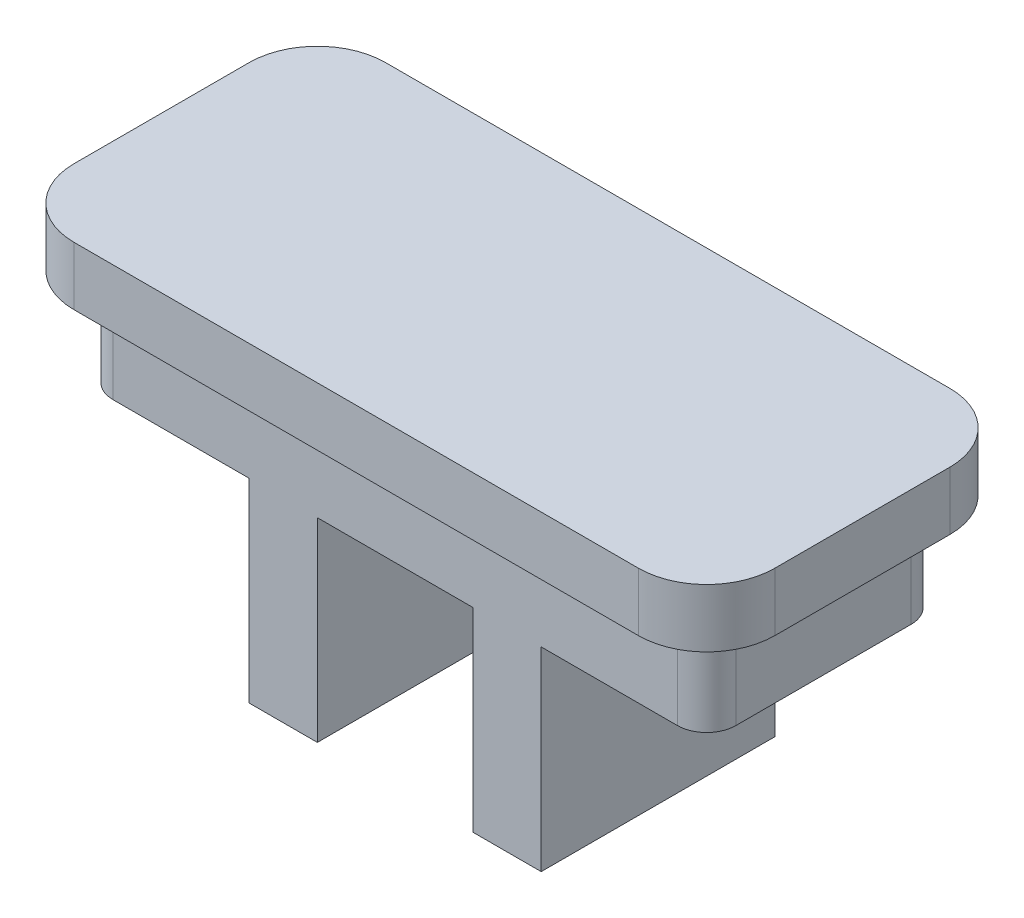
ISO-10303-21;
HEADER;
FILE_DESCRIPTION(('STEP AP214'),'2;1');
FILE_NAME('part.step','',(''),(''),'','','');
FILE_SCHEMA(('AUTOMOTIVE_DESIGN { 1 0 10303 214 1 1 1 1 }'));
ENDSEC;
DATA;
#1=APPLICATION_CONTEXT('core data for automotive mechanical design processes');
#2=APPLICATION_PROTOCOL_DEFINITION('international standard','automotive_design',2000,#1);
#3=PRODUCT_CONTEXT('',#1,'mechanical');
#4=PRODUCT('Part','Part','',(#3));
#5=PRODUCT_RELATED_PRODUCT_CATEGORY('part','',(#4));
#6=PRODUCT_DEFINITION_FORMATION('','',#4);
#7=PRODUCT_DEFINITION_CONTEXT('part definition',#1,'design');
#8=PRODUCT_DEFINITION('design','',#6,#7);
#9=PRODUCT_DEFINITION_SHAPE('','',#8);
#10=(LENGTH_UNIT() NAMED_UNIT(*) SI_UNIT(.MILLI.,.METRE.));
#11=(NAMED_UNIT(*) PLANE_ANGLE_UNIT() SI_UNIT($,.RADIAN.));
#12=(NAMED_UNIT(*) SI_UNIT($,.STERADIAN.) SOLID_ANGLE_UNIT());
#13=UNCERTAINTY_MEASURE_WITH_UNIT(LENGTH_MEASURE(1.E-05),#10,'distance_accuracy_value','');
#14=(GEOMETRIC_REPRESENTATION_CONTEXT(3) GLOBAL_UNCERTAINTY_ASSIGNED_CONTEXT((#13)) GLOBAL_UNIT_ASSIGNED_CONTEXT((#10,
#11,#12)) REPRESENTATION_CONTEXT('',''));
#15=CARTESIAN_POINT('',(0.,0.,0.));
#16=DIRECTION('',(0.,0.,1.));
#17=DIRECTION('',(1.,0.,0.));
#18=AXIS2_PLACEMENT_3D('',#15,#16,#17);
#19=CARTESIAN_POINT('',(30.5,15.,-10.5));
#20=DIRECTION('',(0.,-1.,0.));
#21=DIRECTION('',(0.,0.,-1.));
#22=AXIS2_PLACEMENT_3D('',#19,#20,#21);
#23=CYLINDRICAL_SURFACE('',#22,1.5);
#24=CARTESIAN_POINT('',(30.5,10.,-10.5));
#25=DIRECTION('',(0.,-1.,0.));
#26=DIRECTION('',(0.,0.,-1.));
#27=AXIS2_PLACEMENT_3D('',#24,#25,#26);
#28=CIRCLE('',#27,1.5);
#29=CARTESIAN_POINT('',(30.5,10.,-12.));
#30=VERTEX_POINT('',#29);
#31=CARTESIAN_POINT('',(32.,10.,-10.5));
#32=VERTEX_POINT('',#31);
#33=EDGE_CURVE('E212',#30,#32,#28,.T.);
#34=ORIENTED_EDGE('',*,*,#33,.F.);
#35=DIRECTION('',(0.,-1.,0.));
#36=VECTOR('',#35,1.);
#37=CARTESIAN_POINT('',(30.5,15.,-12.));
#38=LINE('',#37,#36);
#39=CARTESIAN_POINT('',(30.5,15.,-12.));
#40=VERTEX_POINT('',#39);
#41=EDGE_CURVE('E11',#40,#30,#38,.T.);
#42=ORIENTED_EDGE('',*,*,#41,.F.);
#43=CARTESIAN_POINT('',(30.5,15.,-10.5));
#44=DIRECTION('',(0.,1.,0.));
#45=DIRECTION('',(0.,0.,-1.));
#46=AXIS2_PLACEMENT_3D('',#43,#44,#45);
#47=CIRCLE('',#46,1.5);
#48=CARTESIAN_POINT('',(32.,15.,-10.5));
#49=VERTEX_POINT('',#48);
#50=EDGE_CURVE('E328',#49,#40,#47,.T.);
#51=ORIENTED_EDGE('',*,*,#50,.F.);
#52=DIRECTION('',(0.,-1.,0.));
#53=VECTOR('',#52,1.);
#54=CARTESIAN_POINT('',(32.,15.,-10.5));
#55=LINE('',#54,#53);
#56=EDGE_CURVE('E353',#49,#32,#55,.T.);
#57=ORIENTED_EDGE('',*,*,#56,.T.);
#58=EDGE_LOOP('',(#34,#42,#51,#57));
#59=FACE_BOUND('',#58,.T.);
#60=ADVANCED_FACE('F35',(#59),#23,.T.);
#61=CARTESIAN_POINT('',(1.5,15.,-10.5));
#62=DIRECTION('',(0.,-1.,0.));
#63=DIRECTION('',(0.,0.,-1.));
#64=AXIS2_PLACEMENT_3D('',#61,#62,#63);
#65=CYLINDRICAL_SURFACE('',#64,1.5);
#66=CARTESIAN_POINT('',(1.5,10.,-10.5));
#67=DIRECTION('',(0.,-1.,0.));
#68=DIRECTION('',(0.,0.,-1.));
#69=AXIS2_PLACEMENT_3D('',#66,#67,#68);
#70=CIRCLE('',#69,1.5);
#71=CARTESIAN_POINT('',(0.,10.,-10.5));
#72=VERTEX_POINT('',#71);
#73=CARTESIAN_POINT('',(1.50000000000001,10.,-12.));
#74=VERTEX_POINT('',#73);
#75=EDGE_CURVE('E230',#72,#74,#70,.T.);
#76=ORIENTED_EDGE('',*,*,#75,.F.);
#77=DIRECTION('',(0.,-1.,0.));
#78=VECTOR('',#77,1.);
#79=CARTESIAN_POINT('',(0.,15.,-10.5));
#80=LINE('',#79,#78);
#81=CARTESIAN_POINT('',(0.,15.,-10.5));
#82=VERTEX_POINT('',#81);
#83=EDGE_CURVE('E372',#82,#72,#80,.T.);
#84=ORIENTED_EDGE('',*,*,#83,.F.);
#85=CARTESIAN_POINT('',(1.5,15.,-10.5));
#86=DIRECTION('',(0.,1.,0.));
#87=DIRECTION('',(0.,0.,-1.));
#88=AXIS2_PLACEMENT_3D('',#85,#86,#87);
#89=CIRCLE('',#88,1.5);
#90=CARTESIAN_POINT('',(1.50000000000001,15.,-12.));
#91=VERTEX_POINT('',#90);
#92=EDGE_CURVE('E335',#91,#82,#89,.T.);
#93=ORIENTED_EDGE('',*,*,#92,.F.);
#94=DIRECTION('',(0.,-1.,0.));
#95=VECTOR('',#94,1.);
#96=CARTESIAN_POINT('',(1.50000000000001,15.,-12.));
#97=LINE('',#96,#95);
#98=EDGE_CURVE('E42',#91,#74,#97,.T.);
#99=ORIENTED_EDGE('',*,*,#98,.T.);
#100=EDGE_LOOP('',(#76,#84,#93,#99));
#101=FACE_BOUND('',#100,.T.);
#102=ADVANCED_FACE('F378',(#101),#65,.T.);
#103=CARTESIAN_POINT('',(0.,15.,-1.50000000000001));
#104=DIRECTION('',(1.,0.,0.));
#105=DIRECTION('',(0.,0.,-1.));
#106=AXIS2_PLACEMENT_3D('',#103,#104,#105);
#107=PLANE('',#106);
#108=DIRECTION('',(0.,0.,-1.));
#109=VECTOR('',#108,1.);
#110=CARTESIAN_POINT('',(0.,10.,-1.50000000000001));
#111=LINE('',#110,#109);
#112=CARTESIAN_POINT('',(0.,10.,-1.50000000000001));
#113=VERTEX_POINT('',#112);
#114=EDGE_CURVE('E227',#113,#72,#111,.T.);
#115=ORIENTED_EDGE('',*,*,#114,.F.);
#116=DIRECTION('',(0.,-1.,0.));
#117=VECTOR('',#116,1.);
#118=CARTESIAN_POINT('',(0.,15.,-1.50000000000001));
#119=LINE('',#118,#117);
#120=CARTESIAN_POINT('',(0.,15.,-1.50000000000001));
#121=VERTEX_POINT('',#120);
#122=EDGE_CURVE('E369',#121,#113,#119,.T.);
#123=ORIENTED_EDGE('',*,*,#122,.F.);
#124=DIRECTION('',(0.,0.,1.));
#125=VECTOR('',#124,1.);
#126=CARTESIAN_POINT('',(0.,15.,-1.50000000000001));
#127=LINE('',#126,#125);
#128=EDGE_CURVE('E338',#82,#121,#127,.T.);
#129=ORIENTED_EDGE('',*,*,#128,.F.);
#130=ORIENTED_EDGE('',*,*,#83,.T.);
#131=EDGE_LOOP('',(#115,#123,#129,#130));
#132=FACE_BOUND('',#131,.T.);
#133=ADVANCED_FACE('F386',(#132),#107,.F.);
#134=CARTESIAN_POINT('',(1.5,15.,-1.5));
#135=DIRECTION('',(0.,-1.,0.));
#136=DIRECTION('',(0.,0.,-1.));
#137=AXIS2_PLACEMENT_3D('',#134,#135,#136);
#138=CYLINDRICAL_SURFACE('',#137,1.5);
#139=CARTESIAN_POINT('',(1.5,10.,-1.5));
#140=DIRECTION('',(0.,-1.,0.));
#141=DIRECTION('',(0.,0.,-1.));
#142=AXIS2_PLACEMENT_3D('',#139,#140,#141);
#143=CIRCLE('',#142,1.5);
#144=CARTESIAN_POINT('',(1.50000000000001,10.,0.));
#145=VERTEX_POINT('',#144);
#146=EDGE_CURVE('E225',#145,#113,#143,.T.);
#147=ORIENTED_EDGE('',*,*,#146,.F.);
#148=DIRECTION('',(0.,-1.,0.));
#149=VECTOR('',#148,1.);
#150=CARTESIAN_POINT('',(1.50000000000001,15.,0.));
#151=LINE('',#150,#149);
#152=CARTESIAN_POINT('',(1.50000000000001,15.,0.));
#153=VERTEX_POINT('',#152);
#154=EDGE_CURVE('E366',#153,#145,#151,.T.);
#155=ORIENTED_EDGE('',*,*,#154,.F.);
#156=CARTESIAN_POINT('',(1.5,15.,-1.5));
#157=DIRECTION('',(0.,1.,0.));
#158=DIRECTION('',(0.,0.,-1.));
#159=AXIS2_PLACEMENT_3D('',#156,#157,#158);
#160=CIRCLE('',#159,1.5);
#161=EDGE_CURVE('E341',#121,#153,#160,.T.);
#162=ORIENTED_EDGE('',*,*,#161,.F.);
#163=ORIENTED_EDGE('',*,*,#122,.T.);
#164=EDGE_LOOP('',(#147,#155,#162,#163));
#165=FACE_BOUND('',#164,.T.);
#166=ADVANCED_FACE('F390',(#165),#138,.T.);
#167=CARTESIAN_POINT('',(30.5,15.,-1.5));
#168=DIRECTION('',(0.,-1.,0.));
#169=DIRECTION('',(0.,0.,-1.));
#170=AXIS2_PLACEMENT_3D('',#167,#168,#169);
#171=CYLINDRICAL_SURFACE('',#170,1.5);
#172=CARTESIAN_POINT('',(30.5,10.,-1.5));
#173=DIRECTION('',(0.,-1.,0.));
#174=DIRECTION('',(0.,0.,-1.));
#175=AXIS2_PLACEMENT_3D('',#172,#173,#174);
#176=CIRCLE('',#175,1.5);
#177=CARTESIAN_POINT('',(32.,10.,-1.50000000000001));
#178=VERTEX_POINT('',#177);
#179=CARTESIAN_POINT('',(30.5,10.,0.));
#180=VERTEX_POINT('',#179);
#181=EDGE_CURVE('E218',#178,#180,#176,.T.);
#182=ORIENTED_EDGE('',*,*,#181,.F.);
#183=DIRECTION('',(0.,-1.,0.));
#184=VECTOR('',#183,1.);
#185=CARTESIAN_POINT('',(32.,15.,-1.50000000000001));
#186=LINE('',#185,#184);
#187=CARTESIAN_POINT('',(32.,15.,-1.50000000000001));
#188=VERTEX_POINT('',#187);
#189=EDGE_CURVE('E360',#188,#178,#186,.T.);
#190=ORIENTED_EDGE('',*,*,#189,.F.);
#191=CARTESIAN_POINT('',(30.5,15.,-1.5));
#192=DIRECTION('',(0.,1.,0.));
#193=DIRECTION('',(0.,0.,1.));
#194=AXIS2_PLACEMENT_3D('',#191,#192,#193);
#195=CIRCLE('',#194,1.5);
#196=CARTESIAN_POINT('',(30.5,15.,0.));
#197=VERTEX_POINT('',#196);
#198=EDGE_CURVE('E347',#197,#188,#195,.T.);
#199=ORIENTED_EDGE('',*,*,#198,.F.);
#200=DIRECTION('',(0.,-1.,0.));
#201=VECTOR('',#200,1.);
#202=CARTESIAN_POINT('',(30.5,15.,0.));
#203=LINE('',#202,#201);
#204=EDGE_CURVE('E363',#197,#180,#203,.T.);
#205=ORIENTED_EDGE('',*,*,#204,.T.);
#206=EDGE_LOOP('',(#182,#190,#199,#205));
#207=FACE_BOUND('',#206,.T.);
#208=ADVANCED_FACE('F402',(#207),#171,.T.);
#209=CARTESIAN_POINT('',(32.,15.,-1.50000000000001));
#210=DIRECTION('',(-1.,0.,0.));
#211=DIRECTION('',(0.,0.,1.));
#212=AXIS2_PLACEMENT_3D('',#209,#210,#211);
#213=PLANE('',#212);
#214=DIRECTION('',(0.,0.,1.));
#215=VECTOR('',#214,1.);
#216=CARTESIAN_POINT('',(32.,10.,-10.5));
#217=LINE('',#216,#215);
#218=EDGE_CURVE('E214',#32,#178,#217,.T.);
#219=ORIENTED_EDGE('',*,*,#218,.F.);
#220=ORIENTED_EDGE('',*,*,#56,.F.);
#221=DIRECTION('',(0.,0.,-1.));
#222=VECTOR('',#221,1.);
#223=CARTESIAN_POINT('',(32.,15.,-1.50000000000001));
#224=LINE('',#223,#222);
#225=EDGE_CURVE('E350',#188,#49,#224,.T.);
#226=ORIENTED_EDGE('',*,*,#225,.F.);
#227=ORIENTED_EDGE('',*,*,#189,.T.);
#228=EDGE_LOOP('',(#219,#220,#226,#227));
#229=FACE_BOUND('',#228,.T.);
#230=ADVANCED_FACE('F399',(#229),#213,.F.);
#231=CARTESIAN_POINT('',(30.5,0.,-10.5));
#232=DIRECTION('',(0.,-1.,0.));
#233=DIRECTION('',(0.,0.,-1.));
#234=AXIS2_PLACEMENT_3D('',#231,#232,#233);
#235=PLANE('',#234);
#236=DIRECTION('',(0.,0.,1.));
#237=VECTOR('',#236,1.);
#238=CARTESIAN_POINT('',(8.50000000000001,0.,-12.));
#239=LINE('',#238,#237);
#240=CARTESIAN_POINT('',(8.50000000000001,0.,-12.));
#241=VERTEX_POINT('',#240);
#242=CARTESIAN_POINT('',(8.50000000000001,0.,0.));
#243=VERTEX_POINT('',#242);
#244=EDGE_CURVE('E228',#241,#243,#239,.T.);
#245=ORIENTED_EDGE('',*,*,#244,.F.);
#246=DIRECTION('',(-1.,0.,0.));
#247=VECTOR('',#246,1.);
#248=CARTESIAN_POINT('',(1.50000000000001,0.,-12.));
#249=LINE('',#248,#247);
#250=CARTESIAN_POINT('',(12.,0.,-12.));
#251=VERTEX_POINT('',#250);
#252=EDGE_CURVE('E327',#251,#241,#249,.T.);
#253=ORIENTED_EDGE('',*,*,#252,.F.);
#254=DIRECTION('',(0.,0.,-1.));
#255=VECTOR('',#254,1.);
#256=CARTESIAN_POINT('',(12.,0.,0.));
#257=LINE('',#256,#255);
#258=CARTESIAN_POINT('',(12.,0.,0.));
#259=VERTEX_POINT('',#258);
#260=EDGE_CURVE('E223',#259,#251,#257,.T.);
#261=ORIENTED_EDGE('',*,*,#260,.F.);
#262=DIRECTION('',(1.,0.,0.));
#263=VECTOR('',#262,1.);
#264=CARTESIAN_POINT('',(1.50000000000001,0.,0.));
#265=LINE('',#264,#263);
#266=EDGE_CURVE('E332',#243,#259,#265,.T.);
#267=ORIENTED_EDGE('',*,*,#266,.F.);
#268=EDGE_LOOP('',(#245,#253,#261,#267));
#269=FACE_BOUND('',#268,.T.);
#270=ADVANCED_FACE('F423',(#269),#235,.T.);
#271=CARTESIAN_POINT('',(1.50000000000001,15.,-12.));
#272=DIRECTION('',(0.,0.,1.));
#273=DIRECTION('',(1.,0.,0.));
#274=AXIS2_PLACEMENT_3D('',#271,#272,#273);
#275=PLANE('',#274);
#276=DIRECTION('',(1.,0.,0.));
#277=VECTOR('',#276,1.);
#278=CARTESIAN_POINT('',(23.5,10.,-12.));
#279=LINE('',#278,#277);
#280=CARTESIAN_POINT('',(23.5,10.,-12.));
#281=VERTEX_POINT('',#280);
#282=EDGE_CURVE('E206',#281,#30,#279,.T.);
#283=ORIENTED_EDGE('',*,*,#282,.F.);
#284=DIRECTION('',(0.,-1.,0.));
#285=VECTOR('',#284,1.);
#286=CARTESIAN_POINT('',(23.5,10.,-12.));
#287=LINE('',#286,#285);
#288=CARTESIAN_POINT('',(23.5,0.,-12.));
#289=VERTEX_POINT('',#288);
#290=EDGE_CURVE('E193',#281,#289,#287,.T.);
#291=ORIENTED_EDGE('',*,*,#290,.T.);
#292=CARTESIAN_POINT('',(20.,0.,-12.));
#293=VERTEX_POINT('',#292);
#294=EDGE_CURVE('E354',#289,#293,#249,.T.);
#295=ORIENTED_EDGE('',*,*,#294,.T.);
#296=DIRECTION('',(0.,-1.,0.));
#297=VECTOR('',#296,1.);
#298=CARTESIAN_POINT('',(20.,10.,-12.));
#299=LINE('',#298,#297);
#300=CARTESIAN_POINT('',(20.,10.,-12.));
#301=VERTEX_POINT('',#300);
#302=EDGE_CURVE('E265',#301,#293,#299,.T.);
#303=ORIENTED_EDGE('',*,*,#302,.F.);
#304=DIRECTION('',(1.,0.,0.));
#305=VECTOR('',#304,1.);
#306=CARTESIAN_POINT('',(20.,10.,-12.));
#307=LINE('',#306,#305);
#308=CARTESIAN_POINT('',(12.,10.,-12.));
#309=VERTEX_POINT('',#308);
#310=EDGE_CURVE('E245',#309,#301,#307,.T.);
#311=ORIENTED_EDGE('',*,*,#310,.F.);
#312=DIRECTION('',(0.,-1.,0.));
#313=VECTOR('',#312,1.);
#314=CARTESIAN_POINT('',(12.,10.,-12.));
#315=LINE('',#314,#313);
#316=EDGE_CURVE('E255',#309,#251,#315,.T.);
#317=ORIENTED_EDGE('',*,*,#316,.T.);
#318=ORIENTED_EDGE('',*,*,#252,.T.);
#319=DIRECTION('',(0.,-1.,0.));
#320=VECTOR('',#319,1.);
#321=CARTESIAN_POINT('',(8.50000000000001,10.,-12.));
#322=LINE('',#321,#320);
#323=CARTESIAN_POINT('',(8.50000000000001,10.,-12.));
#324=VERTEX_POINT('',#323);
#325=EDGE_CURVE('E237',#324,#241,#322,.T.);
#326=ORIENTED_EDGE('',*,*,#325,.F.);
#327=DIRECTION('',(1.,0.,0.));
#328=VECTOR('',#327,1.);
#329=CARTESIAN_POINT('',(1.50000000000001,10.,-12.));
#330=LINE('',#329,#328);
#331=EDGE_CURVE('E232',#74,#324,#330,.T.);
#332=ORIENTED_EDGE('',*,*,#331,.F.);
#333=ORIENTED_EDGE('',*,*,#98,.F.);
#334=DIRECTION('',(-1.,0.,0.));
#335=VECTOR('',#334,1.);
#336=CARTESIAN_POINT('',(1.50000000000001,15.,-12.));
#337=LINE('',#336,#335);
#338=EDGE_CURVE('E331',#40,#91,#337,.T.);
#339=ORIENTED_EDGE('',*,*,#338,.F.);
#340=ORIENTED_EDGE('',*,*,#41,.T.);
#341=EDGE_LOOP('',(#283,#291,#295,#303,#311,#317,#318,#326,#332,#333,#339,#340));
#342=FACE_BOUND('',#341,.T.);
#343=ADVANCED_FACE('F210',(#342),#275,.F.);
#344=CARTESIAN_POINT('',(1.50000000000001,15.,0.));
#345=DIRECTION('',(0.,0.,-1.));
#346=DIRECTION('',(-1.,0.,0.));
#347=AXIS2_PLACEMENT_3D('',#344,#345,#346);
#348=PLANE('',#347);
#349=CARTESIAN_POINT('',(20.,0.,0.));
#350=VERTEX_POINT('',#349);
#351=CARTESIAN_POINT('',(23.5,0.,0.));
#352=VERTEX_POINT('',#351);
#353=EDGE_CURVE('E356',#350,#352,#265,.T.);
#354=ORIENTED_EDGE('',*,*,#353,.T.);
#355=DIRECTION('',(0.,-1.,0.));
#356=VECTOR('',#355,1.);
#357=CARTESIAN_POINT('',(23.5,10.,0.));
#358=LINE('',#357,#356);
#359=CARTESIAN_POINT('',(23.5,10.,0.));
#360=VERTEX_POINT('',#359);
#361=EDGE_CURVE('E57',#360,#352,#358,.T.);
#362=ORIENTED_EDGE('',*,*,#361,.F.);
#363=DIRECTION('',(-1.,0.,0.));
#364=VECTOR('',#363,1.);
#365=CARTESIAN_POINT('',(30.5,10.,0.));
#366=LINE('',#365,#364);
#367=EDGE_CURVE('E202',#180,#360,#366,.T.);
#368=ORIENTED_EDGE('',*,*,#367,.F.);
#369=ORIENTED_EDGE('',*,*,#204,.F.);
#370=DIRECTION('',(1.,0.,0.));
#371=VECTOR('',#370,1.);
#372=CARTESIAN_POINT('',(1.50000000000001,15.,0.));
#373=LINE('',#372,#371);
#374=EDGE_CURVE('E344',#153,#197,#373,.T.);
#375=ORIENTED_EDGE('',*,*,#374,.F.);
#376=ORIENTED_EDGE('',*,*,#154,.T.);
#377=DIRECTION('',(-1.,0.,0.));
#378=VECTOR('',#377,1.);
#379=CARTESIAN_POINT('',(8.50000000000001,10.,0.));
#380=LINE('',#379,#378);
#381=CARTESIAN_POINT('',(8.50000000000001,10.,0.));
#382=VERTEX_POINT('',#381);
#383=EDGE_CURVE('E235',#382,#145,#380,.T.);
#384=ORIENTED_EDGE('',*,*,#383,.F.);
#385=DIRECTION('',(0.,-1.,0.));
#386=VECTOR('',#385,1.);
#387=CARTESIAN_POINT('',(8.50000000000001,10.,0.));
#388=LINE('',#387,#386);
#389=EDGE_CURVE('E222',#382,#243,#388,.T.);
#390=ORIENTED_EDGE('',*,*,#389,.T.);
#391=ORIENTED_EDGE('',*,*,#266,.T.);
#392=DIRECTION('',(0.,-1.,0.));
#393=VECTOR('',#392,1.);
#394=CARTESIAN_POINT('',(12.,10.,0.));
#395=LINE('',#394,#393);
#396=CARTESIAN_POINT('',(12.,10.,0.));
#397=VERTEX_POINT('',#396);
#398=EDGE_CURVE('E258',#397,#259,#395,.T.);
#399=ORIENTED_EDGE('',*,*,#398,.F.);
#400=DIRECTION('',(-1.,0.,0.));
#401=VECTOR('',#400,1.);
#402=CARTESIAN_POINT('',(20.,10.,0.));
#403=LINE('',#402,#401);
#404=CARTESIAN_POINT('',(20.,10.,0.));
#405=VERTEX_POINT('',#404);
#406=EDGE_CURVE('E252',#405,#397,#403,.T.);
#407=ORIENTED_EDGE('',*,*,#406,.F.);
#408=DIRECTION('',(0.,-1.,0.));
#409=VECTOR('',#408,1.);
#410=CARTESIAN_POINT('',(20.,10.,0.));
#411=LINE('',#410,#409);
#412=EDGE_CURVE('E262',#405,#350,#411,.T.);
#413=ORIENTED_EDGE('',*,*,#412,.T.);
#414=EDGE_LOOP('',(#354,#362,#368,#369,#375,#376,#384,#390,#391,#399,#407,#413));
#415=FACE_BOUND('',#414,.T.);
#416=ADVANCED_FACE('F406',(#415),#348,.F.);
#417=DIRECTION('',(0.,0.,-1.));
#418=VECTOR('',#417,1.);
#419=CARTESIAN_POINT('',(23.5,0.,-12.));
#420=LINE('',#419,#418);
#421=EDGE_CURVE('E198',#352,#289,#420,.T.);
#422=ORIENTED_EDGE('',*,*,#421,.F.);
#423=ORIENTED_EDGE('',*,*,#353,.F.);
#424=DIRECTION('',(0.,0.,1.));
#425=VECTOR('',#424,1.);
#426=CARTESIAN_POINT('',(20.,0.,0.));
#427=LINE('',#426,#425);
#428=EDGE_CURVE('E246',#293,#350,#427,.T.);
#429=ORIENTED_EDGE('',*,*,#428,.F.);
#430=ORIENTED_EDGE('',*,*,#294,.F.);
#431=EDGE_LOOP('',(#422,#423,#429,#430));
#432=FACE_BOUND('',#431,.T.);
#433=ADVANCED_FACE('F411',(#432),#235,.T.);
#434=CARTESIAN_POINT('',(0.,15.,0.));
#435=DIRECTION('',(0.,1.,0.));
#436=DIRECTION('',(0.,0.,1.));
#437=AXIS2_PLACEMENT_3D('',#434,#435,#436);
#438=PLANE('',#437);
#439=DIRECTION('',(1.,0.,0.));
#440=VECTOR('',#439,1.);
#441=CARTESIAN_POINT('',(0.,15.,2.));
#442=LINE('',#441,#440);
#443=CARTESIAN_POINT('',(1.50000000000003,15.,2.));
#444=VERTEX_POINT('',#443);
#445=CARTESIAN_POINT('',(30.5,15.,2.));
#446=VERTEX_POINT('',#445);
#447=EDGE_CURVE('E261',#444,#446,#442,.T.);
#448=ORIENTED_EDGE('',*,*,#447,.F.);
#449=CARTESIAN_POINT('',(1.5,15.,-1.5));
#450=DIRECTION('',(0.,1.,0.));
#451=DIRECTION('',(0.,0.,1.));
#452=AXIS2_PLACEMENT_3D('',#449,#450,#451);
#453=CIRCLE('',#452,3.5);
#454=CARTESIAN_POINT('',(-2.,15.,-1.50000000000001));
#455=VERTEX_POINT('',#454);
#456=EDGE_CURVE('E274',#455,#444,#453,.T.);
#457=ORIENTED_EDGE('',*,*,#456,.F.);
#458=DIRECTION('',(0.,0.,1.));
#459=VECTOR('',#458,1.);
#460=CARTESIAN_POINT('',(-2.,15.,0.));
#461=LINE('',#460,#459);
#462=CARTESIAN_POINT('',(-2.,15.,-10.5));
#463=VERTEX_POINT('',#462);
#464=EDGE_CURVE('E301',#463,#455,#461,.T.);
#465=ORIENTED_EDGE('',*,*,#464,.F.);
#466=CARTESIAN_POINT('',(1.5,15.,-10.5));
#467=DIRECTION('',(0.,1.,0.));
#468=DIRECTION('',(0.,0.,1.));
#469=AXIS2_PLACEMENT_3D('',#466,#467,#468);
#470=CIRCLE('',#469,3.5);
#471=CARTESIAN_POINT('',(1.50000000000001,15.,-14.));
#472=VERTEX_POINT('',#471);
#473=EDGE_CURVE('E299',#472,#463,#470,.T.);
#474=ORIENTED_EDGE('',*,*,#473,.F.);
#475=DIRECTION('',(-1.,0.,0.));
#476=VECTOR('',#475,1.);
#477=CARTESIAN_POINT('',(0.,15.,-14.));
#478=LINE('',#477,#476);
#479=CARTESIAN_POINT('',(30.5,15.,-14.));
#480=VERTEX_POINT('',#479);
#481=EDGE_CURVE('E297',#480,#472,#478,.T.);
#482=ORIENTED_EDGE('',*,*,#481,.F.);
#483=CARTESIAN_POINT('',(30.5,15.,-10.5));
#484=DIRECTION('',(0.,1.,0.));
#485=DIRECTION('',(0.,0.,1.));
#486=AXIS2_PLACEMENT_3D('',#483,#484,#485);
#487=CIRCLE('',#486,3.5);
#488=CARTESIAN_POINT('',(34.,15.,-10.5));
#489=VERTEX_POINT('',#488);
#490=EDGE_CURVE('E295',#489,#480,#487,.T.);
#491=ORIENTED_EDGE('',*,*,#490,.F.);
#492=DIRECTION('',(0.,0.,-1.));
#493=VECTOR('',#492,1.);
#494=CARTESIAN_POINT('',(34.,15.,0.));
#495=LINE('',#494,#493);
#496=CARTESIAN_POINT('',(34.,15.,-1.5));
#497=VERTEX_POINT('',#496);
#498=EDGE_CURVE('E293',#497,#489,#495,.T.);
#499=ORIENTED_EDGE('',*,*,#498,.F.);
#500=CARTESIAN_POINT('',(30.5,15.,-1.5));
#501=DIRECTION('',(0.,1.,0.));
#502=DIRECTION('',(0.,0.,1.));
#503=AXIS2_PLACEMENT_3D('',#500,#501,#502);
#504=CIRCLE('',#503,3.5);
#505=EDGE_CURVE('E291',#446,#497,#504,.T.);
#506=ORIENTED_EDGE('',*,*,#505,.F.);
#507=EDGE_LOOP('',(#448,#457,#465,#474,#482,#491,#499,#506));
#508=FACE_BOUND('',#507,.T.);
#509=ORIENTED_EDGE('',*,*,#225,.T.);
#510=ORIENTED_EDGE('',*,*,#50,.T.);
#511=ORIENTED_EDGE('',*,*,#338,.T.);
#512=ORIENTED_EDGE('',*,*,#92,.T.);
#513=ORIENTED_EDGE('',*,*,#128,.T.);
#514=ORIENTED_EDGE('',*,*,#161,.T.);
#515=ORIENTED_EDGE('',*,*,#374,.T.);
#516=ORIENTED_EDGE('',*,*,#198,.T.);
#517=EDGE_LOOP('',(#509,#510,#511,#512,#513,#514,#515,#516));
#518=FACE_BOUND('',#517,.T.);
#519=ADVANCED_FACE('F393',(#508,#518),#438,.F.);
#520=CARTESIAN_POINT('',(0.,18.,2.));
#521=DIRECTION('',(0.,0.,-1.));
#522=DIRECTION('',(-1.,0.,0.));
#523=AXIS2_PLACEMENT_3D('',#520,#521,#522);
#524=PLANE('',#523);
#525=ORIENTED_EDGE('',*,*,#447,.T.);
#526=DIRECTION('',(0.,-1.,0.));
#527=VECTOR('',#526,1.);
#528=CARTESIAN_POINT('',(30.5,18.,2.));
#529=LINE('',#528,#527);
#530=CARTESIAN_POINT('',(30.5,18.,2.));
#531=VERTEX_POINT('',#530);
#532=EDGE_CURVE('E324',#531,#446,#529,.T.);
#533=ORIENTED_EDGE('',*,*,#532,.F.);
#534=DIRECTION('',(1.,0.,0.));
#535=VECTOR('',#534,1.);
#536=CARTESIAN_POINT('',(0.,18.,2.));
#537=LINE('',#536,#535);
#538=CARTESIAN_POINT('',(1.50000000000003,18.,2.));
#539=VERTEX_POINT('',#538);
#540=EDGE_CURVE('E270',#539,#531,#537,.T.);
#541=ORIENTED_EDGE('',*,*,#540,.F.);
#542=DIRECTION('',(0.,-1.,0.));
#543=VECTOR('',#542,1.);
#544=CARTESIAN_POINT('',(1.50000000000003,18.,2.));
#545=LINE('',#544,#543);
#546=EDGE_CURVE('E288',#539,#444,#545,.T.);
#547=ORIENTED_EDGE('',*,*,#546,.T.);
#548=EDGE_LOOP('',(#525,#533,#541,#547));
#549=FACE_BOUND('',#548,.T.);
#550=ADVANCED_FACE('F467',(#549),#524,.F.);
#551=CARTESIAN_POINT('',(30.5,18.,-1.5));
#552=DIRECTION('',(0.,-1.,0.));
#553=DIRECTION('',(0.,0.,-1.));
#554=AXIS2_PLACEMENT_3D('',#551,#552,#553);
#555=CYLINDRICAL_SURFACE('',#554,3.5);
#556=ORIENTED_EDGE('',*,*,#505,.T.);
#557=DIRECTION('',(0.,-1.,0.));
#558=VECTOR('',#557,1.);
#559=CARTESIAN_POINT('',(34.,18.,-1.5));
#560=LINE('',#559,#558);
#561=CARTESIAN_POINT('',(34.,18.,-1.5));
#562=VERTEX_POINT('',#561);
#563=EDGE_CURVE('E321',#562,#497,#560,.T.);
#564=ORIENTED_EDGE('',*,*,#563,.F.);
#565=CARTESIAN_POINT('',(30.5,18.,-1.5));
#566=DIRECTION('',(0.,1.,0.));
#567=DIRECTION('',(0.,0.,1.));
#568=AXIS2_PLACEMENT_3D('',#565,#566,#567);
#569=CIRCLE('',#568,3.5);
#570=EDGE_CURVE('E273',#531,#562,#569,.T.);
#571=ORIENTED_EDGE('',*,*,#570,.F.);
#572=ORIENTED_EDGE('',*,*,#532,.T.);
#573=EDGE_LOOP('',(#556,#564,#571,#572));
#574=FACE_BOUND('',#573,.T.);
#575=ADVANCED_FACE('F473',(#574),#555,.T.);
#576=CARTESIAN_POINT('',(34.,18.,0.));
#577=DIRECTION('',(-1.,0.,0.));
#578=DIRECTION('',(0.,0.,1.));
#579=AXIS2_PLACEMENT_3D('',#576,#577,#578);
#580=PLANE('',#579);
#581=ORIENTED_EDGE('',*,*,#498,.T.);
#582=DIRECTION('',(0.,-1.,0.));
#583=VECTOR('',#582,1.);
#584=CARTESIAN_POINT('',(34.,18.,-10.5));
#585=LINE('',#584,#583);
#586=CARTESIAN_POINT('',(34.,18.,-10.5));
#587=VERTEX_POINT('',#586);
#588=EDGE_CURVE('E318',#587,#489,#585,.T.);
#589=ORIENTED_EDGE('',*,*,#588,.F.);
#590=DIRECTION('',(0.,0.,-1.));
#591=VECTOR('',#590,1.);
#592=CARTESIAN_POINT('',(34.,18.,0.));
#593=LINE('',#592,#591);
#594=EDGE_CURVE('E276',#562,#587,#593,.T.);
#595=ORIENTED_EDGE('',*,*,#594,.F.);
#596=ORIENTED_EDGE('',*,*,#563,.T.);
#597=EDGE_LOOP('',(#581,#589,#595,#596));
#598=FACE_BOUND('',#597,.T.);
#599=ADVANCED_FACE('F495',(#598),#580,.F.);
#600=CARTESIAN_POINT('',(30.5,18.,-10.5));
#601=DIRECTION('',(0.,-1.,0.));
#602=DIRECTION('',(0.,0.,-1.));
#603=AXIS2_PLACEMENT_3D('',#600,#601,#602);
#604=CYLINDRICAL_SURFACE('',#603,3.5);
#605=ORIENTED_EDGE('',*,*,#490,.T.);
#606=DIRECTION('',(0.,-1.,0.));
#607=VECTOR('',#606,1.);
#608=CARTESIAN_POINT('',(30.5,18.,-14.));
#609=LINE('',#608,#607);
#610=CARTESIAN_POINT('',(30.5,18.,-14.));
#611=VERTEX_POINT('',#610);
#612=EDGE_CURVE('E315',#611,#480,#609,.T.);
#613=ORIENTED_EDGE('',*,*,#612,.F.);
#614=CARTESIAN_POINT('',(30.5,18.,-10.5));
#615=DIRECTION('',(0.,1.,0.));
#616=DIRECTION('',(0.,0.,1.));
#617=AXIS2_PLACEMENT_3D('',#614,#615,#616);
#618=CIRCLE('',#617,3.5);
#619=EDGE_CURVE('E278',#587,#611,#618,.T.);
#620=ORIENTED_EDGE('',*,*,#619,.F.);
#621=ORIENTED_EDGE('',*,*,#588,.T.);
#622=EDGE_LOOP('',(#605,#613,#620,#621));
#623=FACE_BOUND('',#622,.T.);
#624=ADVANCED_FACE('F491',(#623),#604,.T.);
#625=CARTESIAN_POINT('',(0.,18.,-14.));
#626=DIRECTION('',(0.,0.,1.));
#627=DIRECTION('',(1.,0.,0.));
#628=AXIS2_PLACEMENT_3D('',#625,#626,#627);
#629=PLANE('',#628);
#630=ORIENTED_EDGE('',*,*,#481,.T.);
#631=DIRECTION('',(0.,-1.,0.));
#632=VECTOR('',#631,1.);
#633=CARTESIAN_POINT('',(1.50000000000001,18.,-14.));
#634=LINE('',#633,#632);
#635=CARTESIAN_POINT('',(1.50000000000001,18.,-14.));
#636=VERTEX_POINT('',#635);
#637=EDGE_CURVE('E312',#636,#472,#634,.T.);
#638=ORIENTED_EDGE('',*,*,#637,.F.);
#639=DIRECTION('',(-1.,0.,0.));
#640=VECTOR('',#639,1.);
#641=CARTESIAN_POINT('',(0.,18.,-14.));
#642=LINE('',#641,#640);
#643=EDGE_CURVE('E280',#611,#636,#642,.T.);
#644=ORIENTED_EDGE('',*,*,#643,.F.);
#645=ORIENTED_EDGE('',*,*,#612,.T.);
#646=EDGE_LOOP('',(#630,#638,#644,#645));
#647=FACE_BOUND('',#646,.T.);
#648=ADVANCED_FACE('F487',(#647),#629,.F.);
#649=CARTESIAN_POINT('',(1.5,18.,-10.5));
#650=DIRECTION('',(0.,-1.,0.));
#651=DIRECTION('',(0.,0.,-1.));
#652=AXIS2_PLACEMENT_3D('',#649,#650,#651);
#653=CYLINDRICAL_SURFACE('',#652,3.5);
#654=ORIENTED_EDGE('',*,*,#473,.T.);
#655=DIRECTION('',(0.,-1.,0.));
#656=VECTOR('',#655,1.);
#657=CARTESIAN_POINT('',(-2.,18.,-10.5));
#658=LINE('',#657,#656);
#659=CARTESIAN_POINT('',(-2.,18.,-10.5));
#660=VERTEX_POINT('',#659);
#661=EDGE_CURVE('E309',#660,#463,#658,.T.);
#662=ORIENTED_EDGE('',*,*,#661,.F.);
#663=CARTESIAN_POINT('',(1.5,18.,-10.5));
#664=DIRECTION('',(0.,1.,0.));
#665=DIRECTION('',(0.,0.,1.));
#666=AXIS2_PLACEMENT_3D('',#663,#664,#665);
#667=CIRCLE('',#666,3.5);
#668=EDGE_CURVE('E282',#636,#660,#667,.T.);
#669=ORIENTED_EDGE('',*,*,#668,.F.);
#670=ORIENTED_EDGE('',*,*,#637,.T.);
#671=EDGE_LOOP('',(#654,#662,#669,#670));
#672=FACE_BOUND('',#671,.T.);
#673=ADVANCED_FACE('F483',(#672),#653,.T.);
#674=CARTESIAN_POINT('',(-2.,18.,0.));
#675=DIRECTION('',(1.,0.,0.));
#676=DIRECTION('',(0.,0.,-1.));
#677=AXIS2_PLACEMENT_3D('',#674,#675,#676);
#678=PLANE('',#677);
#679=ORIENTED_EDGE('',*,*,#464,.T.);
#680=DIRECTION('',(0.,-1.,0.));
#681=VECTOR('',#680,1.);
#682=CARTESIAN_POINT('',(-2.,18.,-1.50000000000001));
#683=LINE('',#682,#681);
#684=CARTESIAN_POINT('',(-2.,18.,-1.50000000000001));
#685=VERTEX_POINT('',#684);
#686=EDGE_CURVE('E306',#685,#455,#683,.T.);
#687=ORIENTED_EDGE('',*,*,#686,.F.);
#688=DIRECTION('',(0.,0.,1.));
#689=VECTOR('',#688,1.);
#690=CARTESIAN_POINT('',(-2.,18.,0.));
#691=LINE('',#690,#689);
#692=EDGE_CURVE('E284',#660,#685,#691,.T.);
#693=ORIENTED_EDGE('',*,*,#692,.F.);
#694=ORIENTED_EDGE('',*,*,#661,.T.);
#695=EDGE_LOOP('',(#679,#687,#693,#694));
#696=FACE_BOUND('',#695,.T.);
#697=ADVANCED_FACE('F479',(#696),#678,.F.);
#698=CARTESIAN_POINT('',(1.5,18.,-1.5));
#699=DIRECTION('',(0.,-1.,0.));
#700=DIRECTION('',(0.,0.,-1.));
#701=AXIS2_PLACEMENT_3D('',#698,#699,#700);
#702=CYLINDRICAL_SURFACE('',#701,3.5);
#703=ORIENTED_EDGE('',*,*,#456,.T.);
#704=ORIENTED_EDGE('',*,*,#546,.F.);
#705=CARTESIAN_POINT('',(1.5,18.,-1.5));
#706=DIRECTION('',(0.,1.,0.));
#707=DIRECTION('',(0.,0.,1.));
#708=AXIS2_PLACEMENT_3D('',#705,#706,#707);
#709=CIRCLE('',#708,3.5);
#710=EDGE_CURVE('E286',#685,#539,#709,.T.);
#711=ORIENTED_EDGE('',*,*,#710,.F.);
#712=ORIENTED_EDGE('',*,*,#686,.T.);
#713=EDGE_LOOP('',(#703,#704,#711,#712));
#714=FACE_BOUND('',#713,.T.);
#715=ADVANCED_FACE('F438',(#714),#702,.T.);
#716=CARTESIAN_POINT('',(0.,18.,0.));
#717=DIRECTION('',(0.,1.,0.));
#718=DIRECTION('',(0.,0.,1.));
#719=AXIS2_PLACEMENT_3D('',#716,#717,#718);
#720=PLANE('',#719);
#721=ORIENTED_EDGE('',*,*,#540,.T.);
#722=ORIENTED_EDGE('',*,*,#570,.T.);
#723=ORIENTED_EDGE('',*,*,#594,.T.);
#724=ORIENTED_EDGE('',*,*,#619,.T.);
#725=ORIENTED_EDGE('',*,*,#643,.T.);
#726=ORIENTED_EDGE('',*,*,#668,.T.);
#727=ORIENTED_EDGE('',*,*,#692,.T.);
#728=ORIENTED_EDGE('',*,*,#710,.T.);
#729=EDGE_LOOP('',(#721,#722,#723,#724,#725,#726,#727,#728));
#730=FACE_BOUND('',#729,.T.);
#731=ADVANCED_FACE('F431',(#730),#720,.T.);
#732=CARTESIAN_POINT('',(12.,10.,0.));
#733=DIRECTION('',(-1.,0.,0.));
#734=DIRECTION('',(0.,0.,1.));
#735=AXIS2_PLACEMENT_3D('',#732,#733,#734);
#736=PLANE('',#735);
#737=ORIENTED_EDGE('',*,*,#260,.T.);
#738=ORIENTED_EDGE('',*,*,#316,.F.);
#739=DIRECTION('',(0.,0.,-1.));
#740=VECTOR('',#739,1.);
#741=CARTESIAN_POINT('',(12.,10.,0.));
#742=LINE('',#741,#740);
#743=EDGE_CURVE('E242',#397,#309,#742,.T.);
#744=ORIENTED_EDGE('',*,*,#743,.F.);
#745=ORIENTED_EDGE('',*,*,#398,.T.);
#746=EDGE_LOOP('',(#737,#738,#744,#745));
#747=FACE_BOUND('',#746,.T.);
#748=ADVANCED_FACE('F429',(#747),#736,.F.);
#749=CARTESIAN_POINT('',(20.,10.,0.));
#750=DIRECTION('',(1.,0.,0.));
#751=DIRECTION('',(0.,0.,-1.));
#752=AXIS2_PLACEMENT_3D('',#749,#750,#751);
#753=PLANE('',#752);
#754=ORIENTED_EDGE('',*,*,#428,.T.);
#755=ORIENTED_EDGE('',*,*,#412,.F.);
#756=DIRECTION('',(0.,0.,1.));
#757=VECTOR('',#756,1.);
#758=CARTESIAN_POINT('',(20.,10.,0.));
#759=LINE('',#758,#757);
#760=EDGE_CURVE('E249',#301,#405,#759,.T.);
#761=ORIENTED_EDGE('',*,*,#760,.F.);
#762=ORIENTED_EDGE('',*,*,#302,.T.);
#763=EDGE_LOOP('',(#754,#755,#761,#762));
#764=FACE_BOUND('',#763,.T.);
#765=ADVANCED_FACE('F415',(#764),#753,.F.);
#766=CARTESIAN_POINT('',(0.,10.,0.));
#767=DIRECTION('',(0.,1.,0.));
#768=DIRECTION('',(0.,0.,1.));
#769=AXIS2_PLACEMENT_3D('',#766,#767,#768);
#770=PLANE('',#769);
#771=ORIENTED_EDGE('',*,*,#743,.T.);
#772=ORIENTED_EDGE('',*,*,#310,.T.);
#773=ORIENTED_EDGE('',*,*,#760,.T.);
#774=ORIENTED_EDGE('',*,*,#406,.T.);
#775=EDGE_LOOP('',(#771,#772,#773,#774));
#776=FACE_BOUND('',#775,.T.);
#777=ADVANCED_FACE('F417',(#776),#770,.F.);
#778=CARTESIAN_POINT('',(23.5,10.,-12.));
#779=DIRECTION('',(-1.,0.,0.));
#780=DIRECTION('',(0.,0.,1.));
#781=AXIS2_PLACEMENT_3D('',#778,#779,#780);
#782=PLANE('',#781);
#783=ORIENTED_EDGE('',*,*,#421,.T.);
#784=ORIENTED_EDGE('',*,*,#290,.F.);
#785=DIRECTION('',(0.,0.,-1.));
#786=VECTOR('',#785,1.);
#787=CARTESIAN_POINT('',(23.5,10.,-12.));
#788=LINE('',#787,#786);
#789=EDGE_CURVE('E196',#360,#281,#788,.T.);
#790=ORIENTED_EDGE('',*,*,#789,.F.);
#791=ORIENTED_EDGE('',*,*,#361,.T.);
#792=EDGE_LOOP('',(#783,#784,#790,#791));
#793=FACE_BOUND('',#792,.T.);
#794=ADVANCED_FACE('F195',(#793),#782,.F.);
#795=CARTESIAN_POINT('',(30.5,10.,-1.5));
#796=DIRECTION('',(0.,-1.,0.));
#797=DIRECTION('',(0.,0.,-1.));
#798=AXIS2_PLACEMENT_3D('',#795,#796,#797);
#799=PLANE('',#798);
#800=ORIENTED_EDGE('',*,*,#789,.T.);
#801=ORIENTED_EDGE('',*,*,#282,.T.);
#802=ORIENTED_EDGE('',*,*,#33,.T.);
#803=ORIENTED_EDGE('',*,*,#218,.T.);
#804=ORIENTED_EDGE('',*,*,#181,.T.);
#805=ORIENTED_EDGE('',*,*,#367,.T.);
#806=EDGE_LOOP('',(#800,#801,#802,#803,#804,#805));
#807=FACE_BOUND('',#806,.T.);
#808=ADVANCED_FACE('F205',(#807),#799,.T.);
#809=CARTESIAN_POINT('',(8.50000000000001,10.,-12.));
#810=DIRECTION('',(1.,0.,0.));
#811=DIRECTION('',(0.,0.,-1.));
#812=AXIS2_PLACEMENT_3D('',#809,#810,#811);
#813=PLANE('',#812);
#814=ORIENTED_EDGE('',*,*,#244,.T.);
#815=ORIENTED_EDGE('',*,*,#389,.F.);
#816=DIRECTION('',(0.,0.,1.));
#817=VECTOR('',#816,1.);
#818=CARTESIAN_POINT('',(8.50000000000001,10.,-12.));
#819=LINE('',#818,#817);
#820=EDGE_CURVE('E49',#324,#382,#819,.T.);
#821=ORIENTED_EDGE('',*,*,#820,.F.);
#822=ORIENTED_EDGE('',*,*,#325,.T.);
#823=EDGE_LOOP('',(#814,#815,#821,#822));
#824=FACE_BOUND('',#823,.T.);
#825=ADVANCED_FACE('F426',(#824),#813,.F.);
#826=CARTESIAN_POINT('',(1.5,10.,-1.5));
#827=DIRECTION('',(0.,-1.,0.));
#828=DIRECTION('',(0.,0.,-1.));
#829=AXIS2_PLACEMENT_3D('',#826,#827,#828);
#830=PLANE('',#829);
#831=ORIENTED_EDGE('',*,*,#146,.T.);
#832=ORIENTED_EDGE('',*,*,#114,.T.);
#833=ORIENTED_EDGE('',*,*,#75,.T.);
#834=ORIENTED_EDGE('',*,*,#331,.T.);
#835=ORIENTED_EDGE('',*,*,#820,.T.);
#836=ORIENTED_EDGE('',*,*,#383,.T.);
#837=EDGE_LOOP('',(#831,#832,#833,#834,#835,#836));
#838=FACE_BOUND('',#837,.T.);
#839=ADVANCED_FACE('F382',(#838),#830,.T.);
#840=CLOSED_SHELL('',(#60,#102,#133,#166,#208,#230,#270,#343,#416,#433,#519,#550,#575,#599,#624,
#648,#673,#697,#715,#731,#748,#765,#777,#794,#808,#825,#839));
#841=MANIFOLD_SOLID_BREP('B2',#840);
#842=ADVANCED_BREP_SHAPE_REPRESENTATION('',(#18,#841),#14);
#843=SHAPE_DEFINITION_REPRESENTATION(#9,#842);
ENDSEC;
END-ISO-10303-21;
